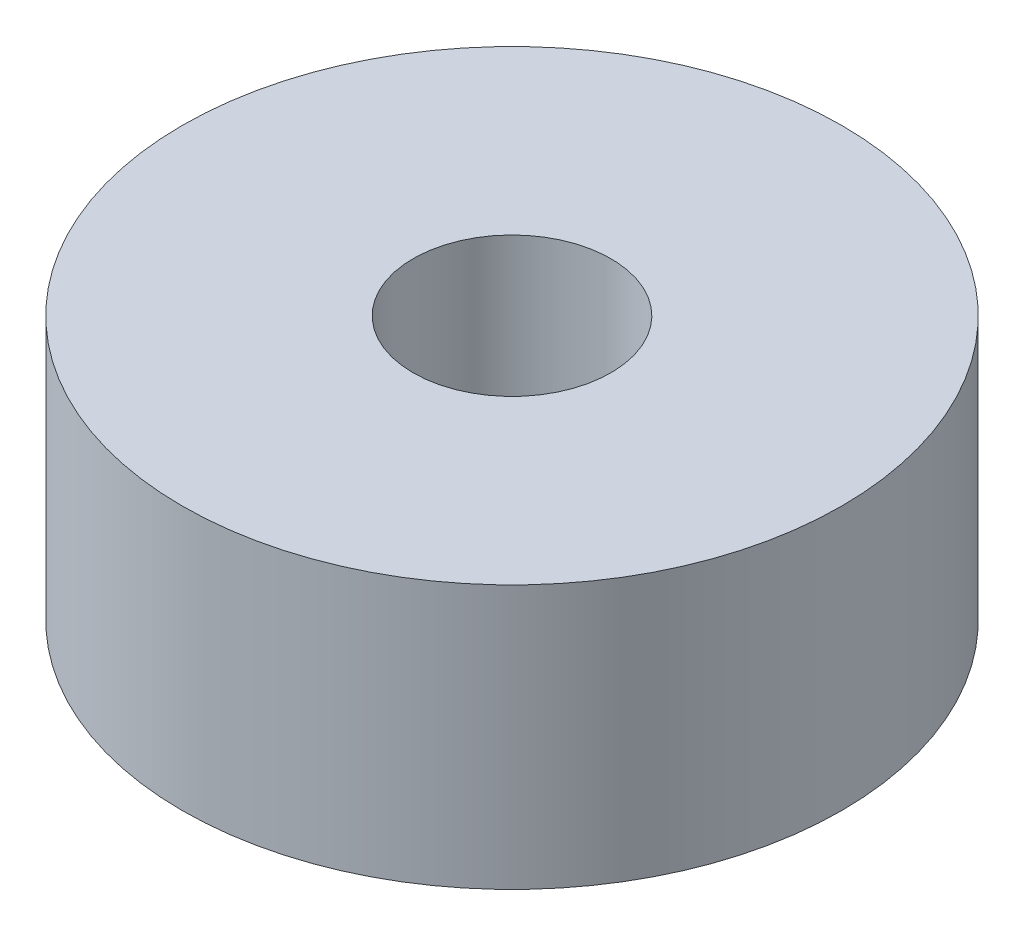
ISO-10303-21;
HEADER;
FILE_DESCRIPTION(('STEP AP214'),'2;1');
FILE_NAME('part.step','',(''),(''),'','','');
FILE_SCHEMA(('AUTOMOTIVE_DESIGN { 1 0 10303 214 1 1 1 1 }'));
ENDSEC;
DATA;
#1=APPLICATION_CONTEXT('core data for automotive mechanical design processes');
#2=APPLICATION_PROTOCOL_DEFINITION('international standard','automotive_design',2000,#1);
#3=PRODUCT_CONTEXT('',#1,'mechanical');
#4=PRODUCT('Part','Part','',(#3));
#5=PRODUCT_RELATED_PRODUCT_CATEGORY('part','',(#4));
#6=PRODUCT_DEFINITION_FORMATION('','',#4);
#7=PRODUCT_DEFINITION_CONTEXT('part definition',#1,'design');
#8=PRODUCT_DEFINITION('design','',#6,#7);
#9=PRODUCT_DEFINITION_SHAPE('','',#8);
#10=(LENGTH_UNIT() NAMED_UNIT(*) SI_UNIT(.MILLI.,.METRE.));
#11=(NAMED_UNIT(*) PLANE_ANGLE_UNIT() SI_UNIT($,.RADIAN.));
#12=(NAMED_UNIT(*) SI_UNIT($,.STERADIAN.) SOLID_ANGLE_UNIT());
#13=UNCERTAINTY_MEASURE_WITH_UNIT(LENGTH_MEASURE(1.E-05),#10,'distance_accuracy_value','');
#14=(GEOMETRIC_REPRESENTATION_CONTEXT(3) GLOBAL_UNCERTAINTY_ASSIGNED_CONTEXT((#13)) GLOBAL_UNIT_ASSIGNED_CONTEXT((#10,
#11,#12)) REPRESENTATION_CONTEXT('',''));
#15=CARTESIAN_POINT('',(0.,0.,0.));
#16=DIRECTION('',(0.,0.,1.));
#17=DIRECTION('',(1.,0.,0.));
#18=AXIS2_PLACEMENT_3D('',#15,#16,#17);
#19=CARTESIAN_POINT('',(0.,4.,0.));
#20=DIRECTION('',(0.,-1.,0.));
#21=DIRECTION('',(0.,0.,-1.));
#22=AXIS2_PLACEMENT_3D('',#19,#20,#21);
#23=CYLINDRICAL_SURFACE('',#22,1.5);
#24=CARTESIAN_POINT('',(0.,4.,0.));
#25=DIRECTION('',(0.,1.,0.));
#26=DIRECTION('',(0.,0.,1.));
#27=AXIS2_PLACEMENT_3D('',#24,#25,#26);
#28=CIRCLE('',#27,1.5);
#29=CARTESIAN_POINT('',(0.,4.,1.5));
#30=VERTEX_POINT('',#29);
#31=EDGE_CURVE('E38',#30,#30,#28,.T.);
#32=ORIENTED_EDGE('',*,*,#31,.T.);
#33=EDGE_LOOP('',(#32));
#34=FACE_BOUND('',#33,.T.);
#35=CARTESIAN_POINT('',(0.,0.,0.));
#36=DIRECTION('',(0.,1.,0.));
#37=DIRECTION('',(0.,0.,1.));
#38=AXIS2_PLACEMENT_3D('',#35,#36,#37);
#39=CIRCLE('',#38,1.5);
#40=CARTESIAN_POINT('',(0.,0.,1.5));
#41=VERTEX_POINT('',#40);
#42=EDGE_CURVE('E44',#41,#41,#39,.T.);
#43=ORIENTED_EDGE('',*,*,#42,.F.);
#44=EDGE_LOOP('',(#43));
#45=FACE_BOUND('',#44,.T.);
#46=ADVANCED_FACE('F31',(#34,#45),#23,.F.);
#47=CARTESIAN_POINT('',(0.,4.,0.));
#48=DIRECTION('',(0.,-1.,0.));
#49=DIRECTION('',(0.,0.,-1.));
#50=AXIS2_PLACEMENT_3D('',#47,#48,#49);
#51=CYLINDRICAL_SURFACE('',#50,5.);
#52=CARTESIAN_POINT('',(0.,4.,0.));
#53=DIRECTION('',(0.,1.,0.));
#54=DIRECTION('',(0.,0.,1.));
#55=AXIS2_PLACEMENT_3D('',#52,#53,#54);
#56=CIRCLE('',#55,5.);
#57=CARTESIAN_POINT('',(0.,4.,5.));
#58=VERTEX_POINT('',#57);
#59=EDGE_CURVE('E10',#58,#58,#56,.T.);
#60=ORIENTED_EDGE('',*,*,#59,.F.);
#61=EDGE_LOOP('',(#60));
#62=FACE_BOUND('',#61,.T.);
#63=CARTESIAN_POINT('',(0.,0.,0.));
#64=DIRECTION('',(0.,1.,0.));
#65=DIRECTION('',(0.,0.,1.));
#66=AXIS2_PLACEMENT_3D('',#63,#64,#65);
#67=CIRCLE('',#66,5.);
#68=CARTESIAN_POINT('',(0.,0.,5.));
#69=VERTEX_POINT('',#68);
#70=EDGE_CURVE('E34',#69,#69,#67,.T.);
#71=ORIENTED_EDGE('',*,*,#70,.T.);
#72=EDGE_LOOP('',(#71));
#73=FACE_BOUND('',#72,.T.);
#74=ADVANCED_FACE('F51',(#62,#73),#51,.T.);
#75=CARTESIAN_POINT('',(0.,4.,0.));
#76=DIRECTION('',(0.,1.,0.));
#77=DIRECTION('',(0.,0.,1.));
#78=AXIS2_PLACEMENT_3D('',#75,#76,#77);
#79=PLANE('',#78);
#80=ORIENTED_EDGE('',*,*,#31,.F.);
#81=EDGE_LOOP('',(#80));
#82=FACE_BOUND('',#81,.T.);
#83=ORIENTED_EDGE('',*,*,#59,.T.);
#84=EDGE_LOOP('',(#83));
#85=FACE_BOUND('',#84,.T.);
#86=ADVANCED_FACE('F55',(#82,#85),#79,.T.);
#87=CARTESIAN_POINT('',(0.,0.,0.));
#88=DIRECTION('',(0.,1.,0.));
#89=DIRECTION('',(0.,0.,1.));
#90=AXIS2_PLACEMENT_3D('',#87,#88,#89);
#91=PLANE('',#90);
#92=ORIENTED_EDGE('',*,*,#42,.T.);
#93=EDGE_LOOP('',(#92));
#94=FACE_BOUND('',#93,.T.);
#95=ORIENTED_EDGE('',*,*,#70,.F.);
#96=EDGE_LOOP('',(#95));
#97=FACE_BOUND('',#96,.T.);
#98=ADVANCED_FACE('F53',(#94,#97),#91,.F.);
#99=CLOSED_SHELL('',(#46,#74,#86,#98));
#100=MANIFOLD_SOLID_BREP('B2',#99);
#101=ADVANCED_BREP_SHAPE_REPRESENTATION('',(#18,#100),#14);
#102=SHAPE_DEFINITION_REPRESENTATION(#9,#101);
ENDSEC;
END-ISO-10303-21;
